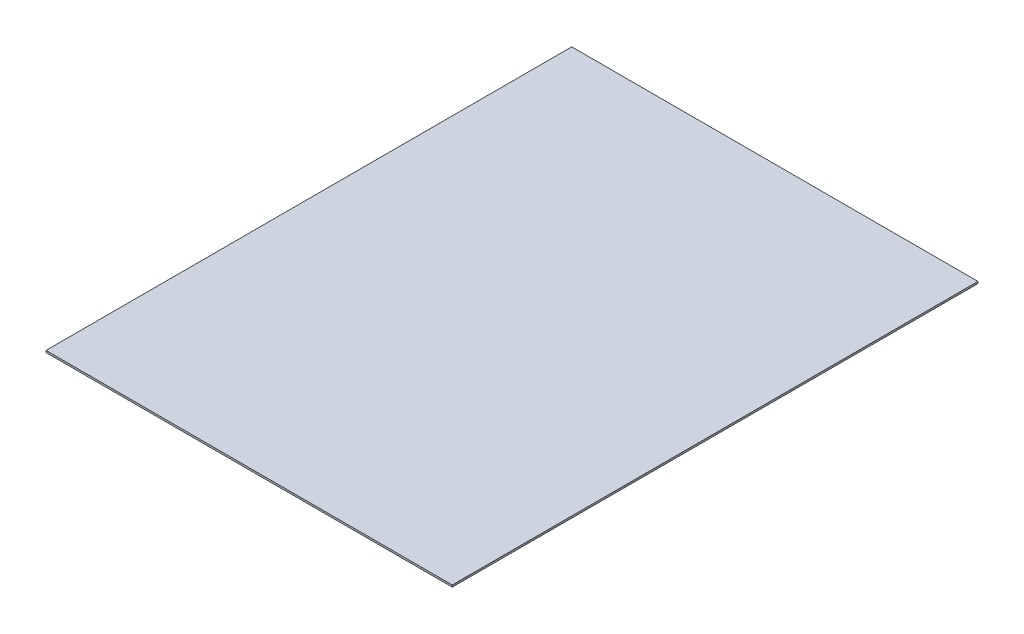
ISO-10303-21;
HEADER;
FILE_DESCRIPTION(('STEP AP214'),'2;1');
FILE_NAME('part.step','',(''),(''),'','','');
FILE_SCHEMA(('AUTOMOTIVE_DESIGN { 1 0 10303 214 1 1 1 1 }'));
ENDSEC;
DATA;
#1=APPLICATION_CONTEXT('core data for automotive mechanical design processes');
#2=APPLICATION_PROTOCOL_DEFINITION('international standard','automotive_design',2000,#1);
#3=PRODUCT_CONTEXT('',#1,'mechanical');
#4=PRODUCT('Part','Part','',(#3));
#5=PRODUCT_RELATED_PRODUCT_CATEGORY('part','',(#4));
#6=PRODUCT_DEFINITION_FORMATION('','',#4);
#7=PRODUCT_DEFINITION_CONTEXT('part definition',#1,'design');
#8=PRODUCT_DEFINITION('design','',#6,#7);
#9=PRODUCT_DEFINITION_SHAPE('','',#8);
#10=(LENGTH_UNIT() NAMED_UNIT(*) SI_UNIT(.MILLI.,.METRE.));
#11=(NAMED_UNIT(*) PLANE_ANGLE_UNIT() SI_UNIT($,.RADIAN.));
#12=(NAMED_UNIT(*) SI_UNIT($,.STERADIAN.) SOLID_ANGLE_UNIT());
#13=UNCERTAINTY_MEASURE_WITH_UNIT(LENGTH_MEASURE(1.E-05),#10,'distance_accuracy_value','');
#14=(GEOMETRIC_REPRESENTATION_CONTEXT(3) GLOBAL_UNCERTAINTY_ASSIGNED_CONTEXT((#13)) GLOBAL_UNIT_ASSIGNED_CONTEXT((#10,
#11,#12)) REPRESENTATION_CONTEXT('',''));
#15=CARTESIAN_POINT('',(0.,0.,0.));
#16=DIRECTION('',(0.,0.,1.));
#17=DIRECTION('',(1.,0.,0.));
#18=AXIS2_PLACEMENT_3D('',#15,#16,#17);
#19=CARTESIAN_POINT('',(-107.95,1.,-139.7));
#20=DIRECTION('',(1.,0.,0.));
#21=DIRECTION('',(0.,0.,-1.));
#22=AXIS2_PLACEMENT_3D('',#19,#20,#21);
#23=PLANE('',#22);
#24=DIRECTION('',(0.,0.,1.));
#25=VECTOR('',#24,1.);
#26=CARTESIAN_POINT('',(-107.95,0.,-139.7));
#27=LINE('',#26,#25);
#28=CARTESIAN_POINT('',(-107.95,0.,-139.7));
#29=VERTEX_POINT('',#28);
#30=CARTESIAN_POINT('',(-107.95,0.,139.7));
#31=VERTEX_POINT('',#30);
#32=EDGE_CURVE('E103',#29,#31,#27,.T.);
#33=ORIENTED_EDGE('',*,*,#32,.T.);
#34=DIRECTION('',(0.,-1.,0.));
#35=VECTOR('',#34,1.);
#36=CARTESIAN_POINT('',(-107.95,1.,139.7));
#37=LINE('',#36,#35);
#38=CARTESIAN_POINT('',(-107.95,1.,139.7));
#39=VERTEX_POINT('',#38);
#40=EDGE_CURVE('E11',#39,#31,#37,.T.);
#41=ORIENTED_EDGE('',*,*,#40,.F.);
#42=DIRECTION('',(0.,0.,1.));
#43=VECTOR('',#42,1.);
#44=CARTESIAN_POINT('',(-107.95,1.,-139.7));
#45=LINE('',#44,#43);
#46=CARTESIAN_POINT('',(-107.95,1.,-139.7));
#47=VERTEX_POINT('',#46);
#48=EDGE_CURVE('E91',#47,#39,#45,.T.);
#49=ORIENTED_EDGE('',*,*,#48,.F.);
#50=DIRECTION('',(0.,-1.,0.));
#51=VECTOR('',#50,1.);
#52=CARTESIAN_POINT('',(-107.95,1.,-139.7));
#53=LINE('',#52,#51);
#54=EDGE_CURVE('E99',#47,#29,#53,.T.);
#55=ORIENTED_EDGE('',*,*,#54,.T.);
#56=EDGE_LOOP('',(#33,#41,#49,#55));
#57=FACE_BOUND('',#56,.T.);
#58=ADVANCED_FACE('F40',(#57),#23,.F.);
#59=CARTESIAN_POINT('',(107.95,1.,139.7));
#60=DIRECTION('',(0.,0.,-1.));
#61=DIRECTION('',(-1.,0.,0.));
#62=AXIS2_PLACEMENT_3D('',#59,#60,#61);
#63=PLANE('',#62);
#64=DIRECTION('',(1.,0.,0.));
#65=VECTOR('',#64,1.);
#66=CARTESIAN_POINT('',(107.95,0.,139.7));
#67=LINE('',#66,#65);
#68=CARTESIAN_POINT('',(107.95,0.,139.7));
#69=VERTEX_POINT('',#68);
#70=EDGE_CURVE('E95',#31,#69,#67,.T.);
#71=ORIENTED_EDGE('',*,*,#70,.T.);
#72=DIRECTION('',(0.,-1.,0.));
#73=VECTOR('',#72,1.);
#74=CARTESIAN_POINT('',(107.95,1.,139.7));
#75=LINE('',#74,#73);
#76=CARTESIAN_POINT('',(107.95,1.,139.7));
#77=VERTEX_POINT('',#76);
#78=EDGE_CURVE('E48',#77,#69,#75,.T.);
#79=ORIENTED_EDGE('',*,*,#78,.F.);
#80=DIRECTION('',(1.,0.,0.));
#81=VECTOR('',#80,1.);
#82=CARTESIAN_POINT('',(107.95,1.,139.7));
#83=LINE('',#82,#81);
#84=EDGE_CURVE('E86',#39,#77,#83,.T.);
#85=ORIENTED_EDGE('',*,*,#84,.F.);
#86=ORIENTED_EDGE('',*,*,#40,.T.);
#87=EDGE_LOOP('',(#71,#79,#85,#86));
#88=FACE_BOUND('',#87,.T.);
#89=ADVANCED_FACE('F94',(#88),#63,.F.);
#90=CARTESIAN_POINT('',(107.95,1.,-139.7));
#91=DIRECTION('',(-1.,0.,0.));
#92=DIRECTION('',(0.,0.,1.));
#93=AXIS2_PLACEMENT_3D('',#90,#91,#92);
#94=PLANE('',#93);
#95=DIRECTION('',(0.,0.,-1.));
#96=VECTOR('',#95,1.);
#97=CARTESIAN_POINT('',(107.95,0.,-139.7));
#98=LINE('',#97,#96);
#99=CARTESIAN_POINT('',(107.95,0.,-139.7));
#100=VERTEX_POINT('',#99);
#101=EDGE_CURVE('E73',#69,#100,#98,.T.);
#102=ORIENTED_EDGE('',*,*,#101,.T.);
#103=DIRECTION('',(0.,-1.,0.));
#104=VECTOR('',#103,1.);
#105=CARTESIAN_POINT('',(107.95,1.,-139.7));
#106=LINE('',#105,#104);
#107=CARTESIAN_POINT('',(107.95,1.,-139.7));
#108=VERTEX_POINT('',#107);
#109=EDGE_CURVE('E96',#108,#100,#106,.T.);
#110=ORIENTED_EDGE('',*,*,#109,.F.);
#111=DIRECTION('',(0.,0.,-1.));
#112=VECTOR('',#111,1.);
#113=CARTESIAN_POINT('',(107.95,1.,-139.7));
#114=LINE('',#113,#112);
#115=EDGE_CURVE('E89',#77,#108,#114,.T.);
#116=ORIENTED_EDGE('',*,*,#115,.F.);
#117=ORIENTED_EDGE('',*,*,#78,.T.);
#118=EDGE_LOOP('',(#102,#110,#116,#117));
#119=FACE_BOUND('',#118,.T.);
#120=ADVANCED_FACE('F97',(#119),#94,.F.);
#121=CARTESIAN_POINT('',(107.95,1.,-139.7));
#122=DIRECTION('',(0.,0.,1.));
#123=DIRECTION('',(1.,0.,0.));
#124=AXIS2_PLACEMENT_3D('',#121,#122,#123);
#125=PLANE('',#124);
#126=DIRECTION('',(-1.,0.,0.));
#127=VECTOR('',#126,1.);
#128=CARTESIAN_POINT('',(107.95,0.,-139.7));
#129=LINE('',#128,#127);
#130=EDGE_CURVE('E79',#100,#29,#129,.T.);
#131=ORIENTED_EDGE('',*,*,#130,.T.);
#132=ORIENTED_EDGE('',*,*,#54,.F.);
#133=DIRECTION('',(-1.,0.,0.));
#134=VECTOR('',#133,1.);
#135=CARTESIAN_POINT('',(107.95,1.,-139.7));
#136=LINE('',#135,#134);
#137=EDGE_CURVE('E56',#108,#47,#136,.T.);
#138=ORIENTED_EDGE('',*,*,#137,.F.);
#139=ORIENTED_EDGE('',*,*,#109,.T.);
#140=EDGE_LOOP('',(#131,#132,#138,#139));
#141=FACE_BOUND('',#140,.T.);
#142=ADVANCED_FACE('F110',(#141),#125,.F.);
#143=CARTESIAN_POINT('',(0.,1.,0.));
#144=DIRECTION('',(0.,-1.,0.));
#145=DIRECTION('',(0.,0.,-1.));
#146=AXIS2_PLACEMENT_3D('',#143,#144,#145);
#147=PLANE('',#146);
#148=ORIENTED_EDGE('',*,*,#48,.T.);
#149=ORIENTED_EDGE('',*,*,#84,.T.);
#150=ORIENTED_EDGE('',*,*,#115,.T.);
#151=ORIENTED_EDGE('',*,*,#137,.T.);
#152=EDGE_LOOP('',(#148,#149,#150,#151));
#153=FACE_BOUND('',#152,.T.);
#154=ADVANCED_FACE('F87',(#153),#147,.F.);
#155=CARTESIAN_POINT('',(0.,0.,0.));
#156=DIRECTION('',(0.,-1.,0.));
#157=DIRECTION('',(0.,0.,-1.));
#158=AXIS2_PLACEMENT_3D('',#155,#156,#157);
#159=PLANE('',#158);
#160=ORIENTED_EDGE('',*,*,#32,.F.);
#161=ORIENTED_EDGE('',*,*,#130,.F.);
#162=ORIENTED_EDGE('',*,*,#101,.F.);
#163=ORIENTED_EDGE('',*,*,#70,.F.);
#164=EDGE_LOOP('',(#160,#161,#162,#163));
#165=FACE_BOUND('',#164,.T.);
#166=ADVANCED_FACE('F113',(#165),#159,.T.);
#167=CLOSED_SHELL('',(#58,#89,#120,#142,#154,#166));
#168=MANIFOLD_SOLID_BREP('B2',#167);
#169=ADVANCED_BREP_SHAPE_REPRESENTATION('',(#18,#168),#14);
#170=SHAPE_DEFINITION_REPRESENTATION(#9,#169);
ENDSEC;
END-ISO-10303-21;
